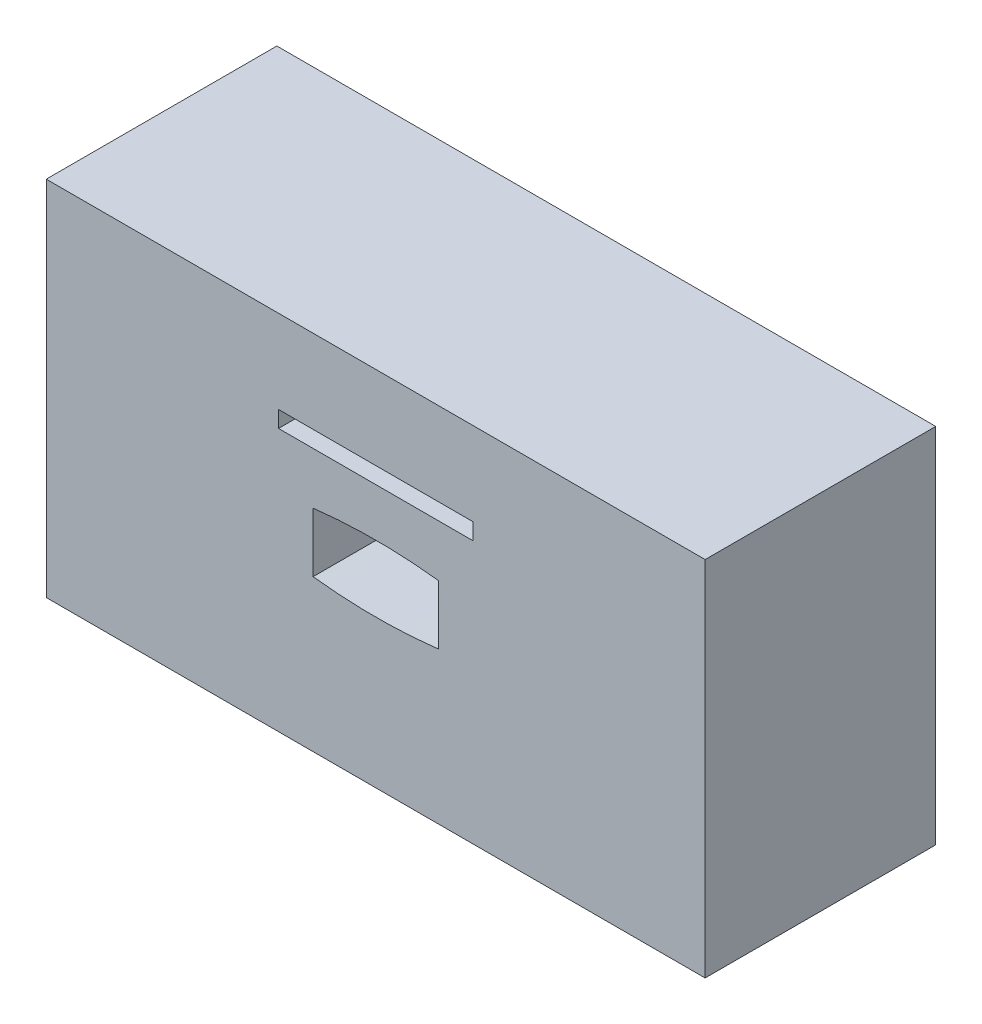
ISO-10303-21;
HEADER;
FILE_DESCRIPTION(('STEP AP214'),'2;1');
FILE_NAME('part.step','',(''),(''),'','','');
FILE_SCHEMA(('AUTOMOTIVE_DESIGN { 1 0 10303 214 1 1 1 1 }'));
ENDSEC;
DATA;
#1=APPLICATION_CONTEXT('core data for automotive mechanical design processes');
#2=APPLICATION_PROTOCOL_DEFINITION('international standard','automotive_design',2000,#1);
#3=PRODUCT_CONTEXT('',#1,'mechanical');
#4=PRODUCT('Part','Part','',(#3));
#5=PRODUCT_RELATED_PRODUCT_CATEGORY('part','',(#4));
#6=PRODUCT_DEFINITION_FORMATION('','',#4);
#7=PRODUCT_DEFINITION_CONTEXT('part definition',#1,'design');
#8=PRODUCT_DEFINITION('design','',#6,#7);
#9=PRODUCT_DEFINITION_SHAPE('','',#8);
#10=(LENGTH_UNIT() NAMED_UNIT(*) SI_UNIT(.MILLI.,.METRE.));
#11=(NAMED_UNIT(*) PLANE_ANGLE_UNIT() SI_UNIT($,.RADIAN.));
#12=(NAMED_UNIT(*) SI_UNIT($,.STERADIAN.) SOLID_ANGLE_UNIT());
#13=UNCERTAINTY_MEASURE_WITH_UNIT(LENGTH_MEASURE(1.E-05),#10,'distance_accuracy_value','');
#14=(GEOMETRIC_REPRESENTATION_CONTEXT(3) GLOBAL_UNCERTAINTY_ASSIGNED_CONTEXT((#13)) GLOBAL_UNIT_ASSIGNED_CONTEXT((#10,
#11,#12)) REPRESENTATION_CONTEXT('',''));
#15=CARTESIAN_POINT('',(0.,0.,0.));
#16=DIRECTION('',(0.,0.,1.));
#17=DIRECTION('',(1.,0.,0.));
#18=AXIS2_PLACEMENT_3D('',#15,#16,#17);
#19=CARTESIAN_POINT('',(50.,27.5,35.));
#20=DIRECTION('',(-1.,0.,0.));
#21=DIRECTION('',(0.,-1.,0.));
#22=AXIS2_PLACEMENT_3D('',#19,#20,#21);
#23=PLANE('',#22);
#24=DIRECTION('',(0.,1.,0.));
#25=VECTOR('',#24,1.);
#26=CARTESIAN_POINT('',(50.,27.5,0.));
#27=LINE('',#26,#25);
#28=CARTESIAN_POINT('',(50.,-27.5,0.));
#29=VERTEX_POINT('',#28);
#30=CARTESIAN_POINT('',(50.,27.5,0.));
#31=VERTEX_POINT('',#30);
#32=EDGE_CURVE('E160',#29,#31,#27,.T.);
#33=ORIENTED_EDGE('',*,*,#32,.T.);
#34=DIRECTION('',(0.,0.,-1.));
#35=VECTOR('',#34,1.);
#36=CARTESIAN_POINT('',(50.,27.5,35.));
#37=LINE('',#36,#35);
#38=CARTESIAN_POINT('',(50.,27.5,35.));
#39=VERTEX_POINT('',#38);
#40=EDGE_CURVE('E11',#39,#31,#37,.T.);
#41=ORIENTED_EDGE('',*,*,#40,.F.);
#42=DIRECTION('',(0.,1.,0.));
#43=VECTOR('',#42,1.);
#44=CARTESIAN_POINT('',(50.,27.5,35.));
#45=LINE('',#44,#43);
#46=CARTESIAN_POINT('',(50.,-27.5,35.));
#47=VERTEX_POINT('',#46);
#48=EDGE_CURVE('E194',#47,#39,#45,.T.);
#49=ORIENTED_EDGE('',*,*,#48,.F.);
#50=DIRECTION('',(0.,0.,-1.));
#51=VECTOR('',#50,1.);
#52=CARTESIAN_POINT('',(50.,-27.5,35.));
#53=LINE('',#52,#51);
#54=EDGE_CURVE('E204',#47,#29,#53,.T.);
#55=ORIENTED_EDGE('',*,*,#54,.T.);
#56=EDGE_LOOP('',(#33,#41,#49,#55));
#57=FACE_BOUND('',#56,.T.);
#58=ADVANCED_FACE('F37',(#57),#23,.F.);
#59=CARTESIAN_POINT('',(-50.,27.5,35.));
#60=DIRECTION('',(0.,-1.,0.));
#61=DIRECTION('',(0.,0.,-1.));
#62=AXIS2_PLACEMENT_3D('',#59,#60,#61);
#63=PLANE('',#62);
#64=DIRECTION('',(-1.,0.,0.));
#65=VECTOR('',#64,1.);
#66=CARTESIAN_POINT('',(-50.,27.5,0.));
#67=LINE('',#66,#65);
#68=CARTESIAN_POINT('',(-50.,27.5,0.));
#69=VERTEX_POINT('',#68);
#70=EDGE_CURVE('E207',#31,#69,#67,.T.);
#71=ORIENTED_EDGE('',*,*,#70,.T.);
#72=DIRECTION('',(0.,0.,-1.));
#73=VECTOR('',#72,1.);
#74=CARTESIAN_POINT('',(-50.,27.5,35.));
#75=LINE('',#74,#73);
#76=CARTESIAN_POINT('',(-50.,27.5,35.));
#77=VERTEX_POINT('',#76);
#78=EDGE_CURVE('E44',#77,#69,#75,.T.);
#79=ORIENTED_EDGE('',*,*,#78,.F.);
#80=DIRECTION('',(-1.,0.,0.));
#81=VECTOR('',#80,1.);
#82=CARTESIAN_POINT('',(-50.,27.5,35.));
#83=LINE('',#82,#81);
#84=EDGE_CURVE('E197',#39,#77,#83,.T.);
#85=ORIENTED_EDGE('',*,*,#84,.F.);
#86=ORIENTED_EDGE('',*,*,#40,.T.);
#87=EDGE_LOOP('',(#71,#79,#85,#86));
#88=FACE_BOUND('',#87,.T.);
#89=ADVANCED_FACE('F237',(#88),#63,.F.);
#90=CARTESIAN_POINT('',(-50.,27.5,35.));
#91=DIRECTION('',(1.,0.,0.));
#92=DIRECTION('',(0.,1.,0.));
#93=AXIS2_PLACEMENT_3D('',#90,#91,#92);
#94=PLANE('',#93);
#95=DIRECTION('',(0.,-1.,0.));
#96=VECTOR('',#95,1.);
#97=CARTESIAN_POINT('',(-50.,27.5,0.));
#98=LINE('',#97,#96);
#99=CARTESIAN_POINT('',(-50.,-27.5,0.));
#100=VERTEX_POINT('',#99);
#101=EDGE_CURVE('E209',#69,#100,#98,.T.);
#102=ORIENTED_EDGE('',*,*,#101,.T.);
#103=DIRECTION('',(0.,0.,-1.));
#104=VECTOR('',#103,1.);
#105=CARTESIAN_POINT('',(-50.,-27.5,35.));
#106=LINE('',#105,#104);
#107=CARTESIAN_POINT('',(-50.,-27.5,35.));
#108=VERTEX_POINT('',#107);
#109=EDGE_CURVE('E214',#108,#100,#106,.T.);
#110=ORIENTED_EDGE('',*,*,#109,.F.);
#111=DIRECTION('',(0.,-1.,0.));
#112=VECTOR('',#111,1.);
#113=CARTESIAN_POINT('',(-50.,27.5,35.));
#114=LINE('',#113,#112);
#115=EDGE_CURVE('E200',#77,#108,#114,.T.);
#116=ORIENTED_EDGE('',*,*,#115,.F.);
#117=ORIENTED_EDGE('',*,*,#78,.T.);
#118=EDGE_LOOP('',(#102,#110,#116,#117));
#119=FACE_BOUND('',#118,.T.);
#120=ADVANCED_FACE('F221',(#119),#94,.F.);
#121=CARTESIAN_POINT('',(-50.,-27.5,35.));
#122=DIRECTION('',(0.,1.,0.));
#123=DIRECTION('',(0.,0.,1.));
#124=AXIS2_PLACEMENT_3D('',#121,#122,#123);
#125=PLANE('',#124);
#126=DIRECTION('',(1.,0.,0.));
#127=VECTOR('',#126,1.);
#128=CARTESIAN_POINT('',(-50.,-27.5,0.));
#129=LINE('',#128,#127);
#130=EDGE_CURVE('E198',#100,#29,#129,.T.);
#131=ORIENTED_EDGE('',*,*,#130,.T.);
#132=ORIENTED_EDGE('',*,*,#54,.F.);
#133=DIRECTION('',(1.,0.,0.));
#134=VECTOR('',#133,1.);
#135=CARTESIAN_POINT('',(-50.,-27.5,35.));
#136=LINE('',#135,#134);
#137=EDGE_CURVE('E202',#108,#47,#136,.T.);
#138=ORIENTED_EDGE('',*,*,#137,.F.);
#139=ORIENTED_EDGE('',*,*,#109,.T.);
#140=EDGE_LOOP('',(#131,#132,#138,#139));
#141=FACE_BOUND('',#140,.T.);
#142=ADVANCED_FACE('F230',(#141),#125,.F.);
#143=CARTESIAN_POINT('',(0.,0.,35.));
#144=DIRECTION('',(0.,0.,1.));
#145=DIRECTION('',(1.,0.,0.));
#146=AXIS2_PLACEMENT_3D('',#143,#144,#145);
#147=PLANE('',#146);
#148=CARTESIAN_POINT('',(0.,75.2009726935064,35.));
#149=DIRECTION('',(0.,0.,1.));
#150=DIRECTION('',(1.,0.,0.));
#151=AXIS2_PLACEMENT_3D('',#148,#149,#150);
#152=CIRCLE('',#151,80.2651546331972);
#153=CARTESIAN_POINT('',(-9.49999999999998,-4.5,35.));
#154=VERTEX_POINT('',#153);
#155=CARTESIAN_POINT('',(9.50000000000001,-4.5,35.));
#156=VERTEX_POINT('',#155);
#157=EDGE_CURVE('E51',#154,#156,#152,.T.);
#158=ORIENTED_EDGE('',*,*,#157,.F.);
#159=DIRECTION('',(0.,-1.,0.));
#160=VECTOR('',#159,1.);
#161=CARTESIAN_POINT('',(-9.49999999999999,4.5,35.));
#162=LINE('',#161,#160);
#163=CARTESIAN_POINT('',(-9.49999999999999,4.5,35.));
#164=VERTEX_POINT('',#163);
#165=EDGE_CURVE('E145',#164,#154,#162,.T.);
#166=ORIENTED_EDGE('',*,*,#165,.F.);
#167=CARTESIAN_POINT('',(0.,-75.2009726935064,35.));
#168=DIRECTION('',(0.,0.,1.));
#169=DIRECTION('',(-1.,0.,0.));
#170=AXIS2_PLACEMENT_3D('',#167,#168,#169);
#171=CIRCLE('',#170,80.2651546331972);
#172=CARTESIAN_POINT('',(9.5,4.5,35.));
#173=VERTEX_POINT('',#172);
#174=EDGE_CURVE('E148',#173,#164,#171,.T.);
#175=ORIENTED_EDGE('',*,*,#174,.F.);
#176=DIRECTION('',(0.,1.,0.));
#177=VECTOR('',#176,1.);
#178=CARTESIAN_POINT('',(9.50000000000001,4.5,35.));
#179=LINE('',#178,#177);
#180=EDGE_CURVE('E154',#156,#173,#179,.T.);
#181=ORIENTED_EDGE('',*,*,#180,.F.);
#182=EDGE_LOOP('',(#158,#166,#175,#181));
#183=FACE_BOUND('',#182,.T.);
#184=DIRECTION('',(0.,1.,0.));
#185=VECTOR('',#184,1.);
#186=CARTESIAN_POINT('',(14.75,14.8575657205886,35.));
#187=LINE('',#186,#185);
#188=CARTESIAN_POINT('',(14.75,12.3575657205886,35.));
#189=VERTEX_POINT('',#188);
#190=CARTESIAN_POINT('',(14.75,14.8575657205886,35.));
#191=VERTEX_POINT('',#190);
#192=EDGE_CURVE('E59',#189,#191,#187,.T.);
#193=ORIENTED_EDGE('',*,*,#192,.F.);
#194=DIRECTION('',(1.,0.,0.));
#195=VECTOR('',#194,1.);
#196=CARTESIAN_POINT('',(-14.75,12.3575657205886,35.));
#197=LINE('',#196,#195);
#198=CARTESIAN_POINT('',(-14.75,12.3575657205886,35.));
#199=VERTEX_POINT('',#198);
#200=EDGE_CURVE('E173',#199,#189,#197,.T.);
#201=ORIENTED_EDGE('',*,*,#200,.F.);
#202=DIRECTION('',(0.,-1.,0.));
#203=VECTOR('',#202,1.);
#204=CARTESIAN_POINT('',(-14.75,14.8575657205886,35.));
#205=LINE('',#204,#203);
#206=CARTESIAN_POINT('',(-14.75,14.8575657205886,35.));
#207=VERTEX_POINT('',#206);
#208=EDGE_CURVE('E176',#207,#199,#205,.T.);
#209=ORIENTED_EDGE('',*,*,#208,.F.);
#210=DIRECTION('',(-1.,0.,0.));
#211=VECTOR('',#210,1.);
#212=CARTESIAN_POINT('',(-14.75,14.8575657205886,35.));
#213=LINE('',#212,#211);
#214=EDGE_CURVE('E180',#191,#207,#213,.T.);
#215=ORIENTED_EDGE('',*,*,#214,.F.);
#216=EDGE_LOOP('',(#193,#201,#209,#215));
#217=FACE_BOUND('',#216,.T.);
#218=ORIENTED_EDGE('',*,*,#48,.T.);
#219=ORIENTED_EDGE('',*,*,#84,.T.);
#220=ORIENTED_EDGE('',*,*,#115,.T.);
#221=ORIENTED_EDGE('',*,*,#137,.T.);
#222=EDGE_LOOP('',(#218,#219,#220,#221));
#223=FACE_BOUND('',#222,.T.);
#224=ADVANCED_FACE('F236',(#183,#217,#223),#147,.T.);
#225=CARTESIAN_POINT('',(0.,0.,0.));
#226=DIRECTION('',(0.,0.,1.));
#227=DIRECTION('',(1.,0.,0.));
#228=AXIS2_PLACEMENT_3D('',#225,#226,#227);
#229=PLANE('',#228);
#230=ORIENTED_EDGE('',*,*,#32,.F.);
#231=ORIENTED_EDGE('',*,*,#130,.F.);
#232=ORIENTED_EDGE('',*,*,#101,.F.);
#233=ORIENTED_EDGE('',*,*,#70,.F.);
#234=EDGE_LOOP('',(#230,#231,#232,#233));
#235=FACE_BOUND('',#234,.T.);
#236=ADVANCED_FACE('F227',(#235),#229,.F.);
#237=CARTESIAN_POINT('',(14.75,14.8575657205886,15.));
#238=DIRECTION('',(1.,0.,0.));
#239=DIRECTION('',(0.,0.,-1.));
#240=AXIS2_PLACEMENT_3D('',#237,#238,#239);
#241=PLANE('',#240);
#242=ORIENTED_EDGE('',*,*,#192,.T.);
#243=DIRECTION('',(0.,0.,1.));
#244=VECTOR('',#243,1.);
#245=CARTESIAN_POINT('',(14.75,14.8575657205886,15.));
#246=LINE('',#245,#244);
#247=CARTESIAN_POINT('',(14.75,14.8575657205886,15.));
#248=VERTEX_POINT('',#247);
#249=EDGE_CURVE('E164',#248,#191,#246,.T.);
#250=ORIENTED_EDGE('',*,*,#249,.F.);
#251=DIRECTION('',(0.,1.,0.));
#252=VECTOR('',#251,1.);
#253=CARTESIAN_POINT('',(14.75,14.8575657205886,15.));
#254=LINE('',#253,#252);
#255=CARTESIAN_POINT('',(14.75,12.3575657205886,15.));
#256=VERTEX_POINT('',#255);
#257=EDGE_CURVE('E177',#256,#248,#254,.T.);
#258=ORIENTED_EDGE('',*,*,#257,.F.);
#259=DIRECTION('',(0.,0.,1.));
#260=VECTOR('',#259,1.);
#261=CARTESIAN_POINT('',(14.75,12.3575657205886,15.));
#262=LINE('',#261,#260);
#263=EDGE_CURVE('E171',#256,#189,#262,.T.);
#264=ORIENTED_EDGE('',*,*,#263,.T.);
#265=EDGE_LOOP('',(#242,#250,#258,#264));
#266=FACE_BOUND('',#265,.T.);
#267=ADVANCED_FACE('F249',(#266),#241,.F.);
#268=CARTESIAN_POINT('',(-14.75,12.3575657205886,15.));
#269=DIRECTION('',(0.,-1.,0.));
#270=DIRECTION('',(0.,0.,-1.));
#271=AXIS2_PLACEMENT_3D('',#268,#269,#270);
#272=PLANE('',#271);
#273=ORIENTED_EDGE('',*,*,#200,.T.);
#274=ORIENTED_EDGE('',*,*,#263,.F.);
#275=DIRECTION('',(1.,0.,0.));
#276=VECTOR('',#275,1.);
#277=CARTESIAN_POINT('',(-14.75,12.3575657205886,15.));
#278=LINE('',#277,#276);
#279=CARTESIAN_POINT('',(-14.75,12.3575657205886,15.));
#280=VERTEX_POINT('',#279);
#281=EDGE_CURVE('E166',#280,#256,#278,.T.);
#282=ORIENTED_EDGE('',*,*,#281,.F.);
#283=DIRECTION('',(0.,0.,1.));
#284=VECTOR('',#283,1.);
#285=CARTESIAN_POINT('',(-14.75,12.3575657205886,15.));
#286=LINE('',#285,#284);
#287=EDGE_CURVE('E169',#280,#199,#286,.T.);
#288=ORIENTED_EDGE('',*,*,#287,.T.);
#289=EDGE_LOOP('',(#273,#274,#282,#288));
#290=FACE_BOUND('',#289,.T.);
#291=ADVANCED_FACE('F258',(#290),#272,.F.);
#292=CARTESIAN_POINT('',(-14.75,14.8575657205886,15.));
#293=DIRECTION('',(-1.,0.,0.));
#294=DIRECTION('',(0.,0.,1.));
#295=AXIS2_PLACEMENT_3D('',#292,#293,#294);
#296=PLANE('',#295);
#297=ORIENTED_EDGE('',*,*,#208,.T.);
#298=ORIENTED_EDGE('',*,*,#287,.F.);
#299=DIRECTION('',(0.,-1.,0.));
#300=VECTOR('',#299,1.);
#301=CARTESIAN_POINT('',(-14.75,14.8575657205886,15.));
#302=LINE('',#301,#300);
#303=CARTESIAN_POINT('',(-14.75,14.8575657205886,15.));
#304=VERTEX_POINT('',#303);
#305=EDGE_CURVE('E186',#304,#280,#302,.T.);
#306=ORIENTED_EDGE('',*,*,#305,.F.);
#307=DIRECTION('',(0.,0.,1.));
#308=VECTOR('',#307,1.);
#309=CARTESIAN_POINT('',(-14.75,14.8575657205886,15.));
#310=LINE('',#309,#308);
#311=EDGE_CURVE('E167',#304,#207,#310,.T.);
#312=ORIENTED_EDGE('',*,*,#311,.T.);
#313=EDGE_LOOP('',(#297,#298,#306,#312));
#314=FACE_BOUND('',#313,.T.);
#315=ADVANCED_FACE('F261',(#314),#296,.F.);
#316=CARTESIAN_POINT('',(-14.75,14.8575657205886,15.));
#317=DIRECTION('',(0.,1.,0.));
#318=DIRECTION('',(-1.,0.,0.));
#319=AXIS2_PLACEMENT_3D('',#316,#317,#318);
#320=PLANE('',#319);
#321=ORIENTED_EDGE('',*,*,#214,.T.);
#322=ORIENTED_EDGE('',*,*,#311,.F.);
#323=DIRECTION('',(-1.,0.,0.));
#324=VECTOR('',#323,1.);
#325=CARTESIAN_POINT('',(-14.75,14.8575657205886,15.));
#326=LINE('',#325,#324);
#327=EDGE_CURVE('E189',#248,#304,#326,.T.);
#328=ORIENTED_EDGE('',*,*,#327,.F.);
#329=ORIENTED_EDGE('',*,*,#249,.T.);
#330=EDGE_LOOP('',(#321,#322,#328,#329));
#331=FACE_BOUND('',#330,.T.);
#332=ADVANCED_FACE('F256',(#331),#320,.F.);
#333=CARTESIAN_POINT('',(0.,0.,15.));
#334=DIRECTION('',(0.,0.,1.));
#335=DIRECTION('',(1.,0.,0.));
#336=AXIS2_PLACEMENT_3D('',#333,#334,#335);
#337=PLANE('',#336);
#338=ORIENTED_EDGE('',*,*,#257,.T.);
#339=ORIENTED_EDGE('',*,*,#327,.T.);
#340=ORIENTED_EDGE('',*,*,#305,.T.);
#341=ORIENTED_EDGE('',*,*,#281,.T.);
#342=EDGE_LOOP('',(#338,#339,#340,#341));
#343=FACE_BOUND('',#342,.T.);
#344=ADVANCED_FACE('F253',(#343),#337,.T.);
#345=CARTESIAN_POINT('',(0.,75.2009726935064,15.));
#346=DIRECTION('',(0.,0.,1.));
#347=DIRECTION('',(1.,0.,0.));
#348=AXIS2_PLACEMENT_3D('',#345,#346,#347);
#349=CYLINDRICAL_SURFACE('',#348,80.2651546331972);
#350=ORIENTED_EDGE('',*,*,#157,.T.);
#351=DIRECTION('',(0.,0.,1.));
#352=VECTOR('',#351,1.);
#353=CARTESIAN_POINT('',(9.50000000000001,-4.5,15.));
#354=LINE('',#353,#352);
#355=CARTESIAN_POINT('',(9.50000000000001,-4.5,15.));
#356=VERTEX_POINT('',#355);
#357=EDGE_CURVE('E123',#356,#156,#354,.T.);
#358=ORIENTED_EDGE('',*,*,#357,.F.);
#359=CARTESIAN_POINT('',(0.,75.2009726935064,15.));
#360=DIRECTION('',(0.,0.,1.));
#361=DIRECTION('',(1.,0.,0.));
#362=AXIS2_PLACEMENT_3D('',#359,#360,#361);
#363=CIRCLE('',#362,80.2651546331972);
#364=CARTESIAN_POINT('',(-9.49999999999998,-4.5,15.));
#365=VERTEX_POINT('',#364);
#366=EDGE_CURVE('E127',#365,#356,#363,.T.);
#367=ORIENTED_EDGE('',*,*,#366,.F.);
#368=DIRECTION('',(0.,0.,1.));
#369=VECTOR('',#368,1.);
#370=CARTESIAN_POINT('',(-9.49999999999998,-4.5,15.));
#371=LINE('',#370,#369);
#372=EDGE_CURVE('E158',#365,#154,#371,.T.);
#373=ORIENTED_EDGE('',*,*,#372,.T.);
#374=EDGE_LOOP('',(#350,#358,#367,#373));
#375=FACE_BOUND('',#374,.T.);
#376=ADVANCED_FACE('F125',(#375),#349,.F.);
#377=CARTESIAN_POINT('',(-9.49999999999999,4.5,15.));
#378=DIRECTION('',(-1.,0.,0.));
#379=DIRECTION('',(0.,-1.,0.));
#380=AXIS2_PLACEMENT_3D('',#377,#378,#379);
#381=PLANE('',#380);
#382=ORIENTED_EDGE('',*,*,#165,.T.);
#383=ORIENTED_EDGE('',*,*,#372,.F.);
#384=DIRECTION('',(0.,-1.,0.));
#385=VECTOR('',#384,1.);
#386=CARTESIAN_POINT('',(-9.49999999999999,4.5,15.));
#387=LINE('',#386,#385);
#388=CARTESIAN_POINT('',(-9.49999999999999,4.5,15.));
#389=VERTEX_POINT('',#388);
#390=EDGE_CURVE('E133',#389,#365,#387,.T.);
#391=ORIENTED_EDGE('',*,*,#390,.F.);
#392=DIRECTION('',(0.,0.,1.));
#393=VECTOR('',#392,1.);
#394=CARTESIAN_POINT('',(-9.49999999999999,4.5,15.));
#395=LINE('',#394,#393);
#396=EDGE_CURVE('E161',#389,#164,#395,.T.);
#397=ORIENTED_EDGE('',*,*,#396,.T.);
#398=EDGE_LOOP('',(#382,#383,#391,#397));
#399=FACE_BOUND('',#398,.T.);
#400=ADVANCED_FACE('F273',(#399),#381,.F.);
#401=CARTESIAN_POINT('',(0.,-75.2009726935064,15.));
#402=DIRECTION('',(0.,0.,1.));
#403=DIRECTION('',(1.,0.,0.));
#404=AXIS2_PLACEMENT_3D('',#401,#402,#403);
#405=CYLINDRICAL_SURFACE('',#404,80.2651546331972);
#406=ORIENTED_EDGE('',*,*,#174,.T.);
#407=ORIENTED_EDGE('',*,*,#396,.F.);
#408=CARTESIAN_POINT('',(0.,-75.2009726935064,15.));
#409=DIRECTION('',(0.,0.,1.));
#410=DIRECTION('',(-1.,0.,0.));
#411=AXIS2_PLACEMENT_3D('',#408,#409,#410);
#412=CIRCLE('',#411,80.2651546331972);
#413=CARTESIAN_POINT('',(9.5,4.5,15.));
#414=VERTEX_POINT('',#413);
#415=EDGE_CURVE('E141',#414,#389,#412,.T.);
#416=ORIENTED_EDGE('',*,*,#415,.F.);
#417=DIRECTION('',(0.,0.,1.));
#418=VECTOR('',#417,1.);
#419=CARTESIAN_POINT('',(9.5,4.5,15.));
#420=LINE('',#419,#418);
#421=EDGE_CURVE('E132',#414,#173,#420,.T.);
#422=ORIENTED_EDGE('',*,*,#421,.T.);
#423=EDGE_LOOP('',(#406,#407,#416,#422));
#424=FACE_BOUND('',#423,.T.);
#425=ADVANCED_FACE('F276',(#424),#405,.F.);
#426=CARTESIAN_POINT('',(9.50000000000001,4.5,15.));
#427=DIRECTION('',(1.,0.,0.));
#428=DIRECTION('',(0.,0.,-1.));
#429=AXIS2_PLACEMENT_3D('',#426,#427,#428);
#430=PLANE('',#429);
#431=ORIENTED_EDGE('',*,*,#180,.T.);
#432=ORIENTED_EDGE('',*,*,#421,.F.);
#433=DIRECTION('',(0.,1.,0.));
#434=VECTOR('',#433,1.);
#435=CARTESIAN_POINT('',(9.50000000000001,4.5,15.));
#436=LINE('',#435,#434);
#437=EDGE_CURVE('E136',#356,#414,#436,.T.);
#438=ORIENTED_EDGE('',*,*,#437,.F.);
#439=ORIENTED_EDGE('',*,*,#357,.T.);
#440=EDGE_LOOP('',(#431,#432,#438,#439));
#441=FACE_BOUND('',#440,.T.);
#442=ADVANCED_FACE('F137',(#441),#430,.F.);
#443=CARTESIAN_POINT('',(0.,75.2009726935064,15.));
#444=DIRECTION('',(0.,0.,1.));
#445=DIRECTION('',(1.,0.,0.));
#446=AXIS2_PLACEMENT_3D('',#443,#444,#445);
#447=PLANE('',#446);
#448=ORIENTED_EDGE('',*,*,#366,.T.);
#449=ORIENTED_EDGE('',*,*,#437,.T.);
#450=ORIENTED_EDGE('',*,*,#415,.T.);
#451=ORIENTED_EDGE('',*,*,#390,.T.);
#452=EDGE_LOOP('',(#448,#449,#450,#451));
#453=FACE_BOUND('',#452,.T.);
#454=ADVANCED_FACE('F143',(#453),#447,.T.);
#455=CLOSED_SHELL('',(#58,#89,#120,#142,#224,#236,#267,#291,#315,#332,#344,#376,#400,#425,#442,#454));
#456=MANIFOLD_SOLID_BREP('B2',#455);
#457=ADVANCED_BREP_SHAPE_REPRESENTATION('',(#18,#456),#14);
#458=SHAPE_DEFINITION_REPRESENTATION(#9,#457);
ENDSEC;
END-ISO-10303-21;
